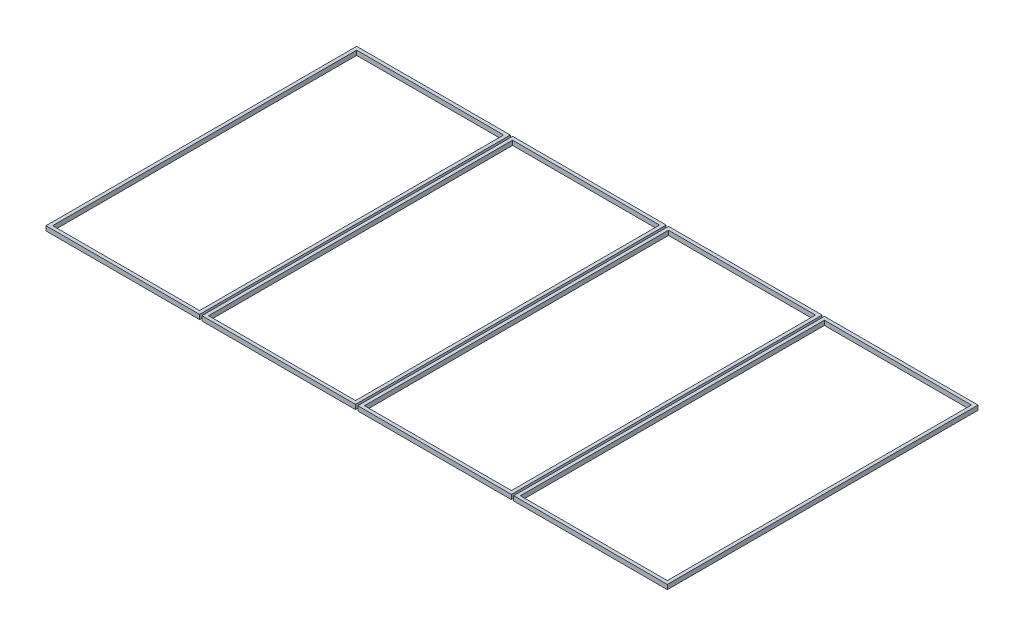
ISO-10303-21;
HEADER;
FILE_DESCRIPTION(('STEP AP214'),'2;1');
FILE_NAME('part.step','',(''),(''),'','','');
FILE_SCHEMA(('AUTOMOTIVE_DESIGN { 1 0 10303 214 1 1 1 1 }'));
ENDSEC;
DATA;
#1=APPLICATION_CONTEXT('core data for automotive mechanical design processes');
#2=APPLICATION_PROTOCOL_DEFINITION('international standard','automotive_design',2000,#1);
#3=PRODUCT_CONTEXT('',#1,'mechanical');
#4=PRODUCT('Part','Part','',(#3));
#5=PRODUCT_RELATED_PRODUCT_CATEGORY('part','',(#4));
#6=PRODUCT_DEFINITION_FORMATION('','',#4);
#7=PRODUCT_DEFINITION_CONTEXT('part definition',#1,'design');
#8=PRODUCT_DEFINITION('design','',#6,#7);
#9=PRODUCT_DEFINITION_SHAPE('','',#8);
#10=(LENGTH_UNIT() NAMED_UNIT(*) SI_UNIT(.MILLI.,.METRE.));
#11=(NAMED_UNIT(*) PLANE_ANGLE_UNIT() SI_UNIT($,.RADIAN.));
#12=(NAMED_UNIT(*) SI_UNIT($,.STERADIAN.) SOLID_ANGLE_UNIT());
#13=UNCERTAINTY_MEASURE_WITH_UNIT(LENGTH_MEASURE(1.E-05),#10,'distance_accuracy_value','');
#14=(GEOMETRIC_REPRESENTATION_CONTEXT(3) GLOBAL_UNCERTAINTY_ASSIGNED_CONTEXT((#13)) GLOBAL_UNIT_ASSIGNED_CONTEXT((#10,
#11,#12)) REPRESENTATION_CONTEXT('',''));
#15=CARTESIAN_POINT('',(0.,0.,0.));
#16=DIRECTION('',(0.,0.,1.));
#17=DIRECTION('',(1.,0.,0.));
#18=AXIS2_PLACEMENT_3D('',#15,#16,#17);
#19=CARTESIAN_POINT('',(0.,18.,0.));
#20=DIRECTION('',(0.,1.,0.));
#21=DIRECTION('',(0.,0.,1.));
#22=AXIS2_PLACEMENT_3D('',#19,#20,#21);
#23=PLANE('',#22);
#24=DIRECTION('',(1.,0.,0.));
#25=VECTOR('',#24,1.);
#26=CARTESIAN_POINT('',(1224.5,18.,0.));
#27=LINE('',#26,#25);
#28=CARTESIAN_POINT('',(1224.5,18.,0.));
#29=VERTEX_POINT('',#28);
#30=CARTESIAN_POINT('',(1827.75,18.,0.));
#31=VERTEX_POINT('',#30);
#32=EDGE_CURVE('E144',#29,#31,#27,.T.);
#33=ORIENTED_EDGE('',*,*,#32,.T.);
#34=DIRECTION('',(0.,0.,-1.));
#35=VECTOR('',#34,1.);
#36=CARTESIAN_POINT('',(1827.75,18.,0.));
#37=LINE('',#36,#35);
#38=CARTESIAN_POINT('',(1827.75,18.,-1220.));
#39=VERTEX_POINT('',#38);
#40=EDGE_CURVE('E146',#31,#39,#37,.T.);
#41=ORIENTED_EDGE('',*,*,#40,.T.);
#42=DIRECTION('',(-1.,0.,0.));
#43=VECTOR('',#42,1.);
#44=CARTESIAN_POINT('',(1224.5,18.,-1220.));
#45=LINE('',#44,#43);
#46=CARTESIAN_POINT('',(1224.5,18.,-1220.));
#47=VERTEX_POINT('',#46);
#48=EDGE_CURVE('E149',#39,#47,#45,.T.);
#49=ORIENTED_EDGE('',*,*,#48,.T.);
#50=DIRECTION('',(0.,0.,1.));
#51=VECTOR('',#50,1.);
#52=CARTESIAN_POINT('',(1224.5,18.,0.));
#53=LINE('',#52,#51);
#54=EDGE_CURVE('E151',#47,#29,#53,.T.);
#55=ORIENTED_EDGE('',*,*,#54,.T.);
#56=EDGE_LOOP('',(#33,#41,#49,#55));
#57=FACE_BOUND('',#56,.T.);
#58=DIRECTION('',(1.,0.,0.));
#59=VECTOR('',#58,1.);
#60=CARTESIAN_POINT('',(1237.5,18.,-13.));
#61=LINE('',#60,#59);
#62=CARTESIAN_POINT('',(1237.5,18.,-13.));
#63=VERTEX_POINT('',#62);
#64=CARTESIAN_POINT('',(1814.75,18.,-13.));
#65=VERTEX_POINT('',#64);
#66=EDGE_CURVE('E116',#63,#65,#61,.T.);
#67=ORIENTED_EDGE('',*,*,#66,.F.);
#68=DIRECTION('',(0.,0.,1.));
#69=VECTOR('',#68,1.);
#70=CARTESIAN_POINT('',(1237.5,18.,-13.));
#71=LINE('',#70,#69);
#72=CARTESIAN_POINT('',(1237.5,18.,-1207.));
#73=VERTEX_POINT('',#72);
#74=EDGE_CURVE('E108',#73,#63,#71,.T.);
#75=ORIENTED_EDGE('',*,*,#74,.F.);
#76=DIRECTION('',(-1.,0.,0.));
#77=VECTOR('',#76,1.);
#78=CARTESIAN_POINT('',(1237.5,18.,-1207.));
#79=LINE('',#78,#77);
#80=CARTESIAN_POINT('',(1814.75,18.,-1207.));
#81=VERTEX_POINT('',#80);
#82=EDGE_CURVE('E130',#81,#73,#79,.T.);
#83=ORIENTED_EDGE('',*,*,#82,.F.);
#84=DIRECTION('',(0.,0.,-1.));
#85=VECTOR('',#84,1.);
#86=CARTESIAN_POINT('',(1814.75,18.,-13.));
#87=LINE('',#86,#85);
#88=EDGE_CURVE('E128',#65,#81,#87,.T.);
#89=ORIENTED_EDGE('',*,*,#88,.F.);
#90=EDGE_LOOP('',(#67,#75,#83,#89));
#91=FACE_BOUND('',#90,.T.);
#92=ADVANCED_FACE('F43',(#57,#91),#23,.T.);
#93=CARTESIAN_POINT('',(0.,0.,0.));
#94=DIRECTION('',(0.,1.,0.));
#95=DIRECTION('',(0.,0.,1.));
#96=AXIS2_PLACEMENT_3D('',#93,#94,#95);
#97=PLANE('',#96);
#98=DIRECTION('',(1.,0.,0.));
#99=VECTOR('',#98,1.);
#100=CARTESIAN_POINT('',(1814.75,0.,0.));
#101=LINE('',#100,#99);
#102=CARTESIAN_POINT('',(1224.5,0.,0.));
#103=VERTEX_POINT('',#102);
#104=CARTESIAN_POINT('',(1827.75,0.,0.));
#105=VERTEX_POINT('',#104);
#106=EDGE_CURVE('E124',#103,#105,#101,.T.);
#107=ORIENTED_EDGE('',*,*,#106,.F.);
#108=DIRECTION('',(0.,0.,1.));
#109=VECTOR('',#108,1.);
#110=CARTESIAN_POINT('',(1224.5,0.,0.));
#111=LINE('',#110,#109);
#112=CARTESIAN_POINT('',(1224.5,0.,-1220.));
#113=VERTEX_POINT('',#112);
#114=EDGE_CURVE('E147',#113,#103,#111,.T.);
#115=ORIENTED_EDGE('',*,*,#114,.F.);
#116=DIRECTION('',(-1.,0.,0.));
#117=VECTOR('',#116,1.);
#118=CARTESIAN_POINT('',(1224.5,0.,-1220.));
#119=LINE('',#118,#117);
#120=CARTESIAN_POINT('',(1827.75,0.,-1220.));
#121=VERTEX_POINT('',#120);
#122=EDGE_CURVE('E157',#121,#113,#119,.T.);
#123=ORIENTED_EDGE('',*,*,#122,.F.);
#124=DIRECTION('',(0.,0.,-1.));
#125=VECTOR('',#124,1.);
#126=CARTESIAN_POINT('',(1827.75,0.,0.));
#127=LINE('',#126,#125);
#128=EDGE_CURVE('E155',#105,#121,#127,.T.);
#129=ORIENTED_EDGE('',*,*,#128,.F.);
#130=EDGE_LOOP('',(#107,#115,#123,#129));
#131=FACE_BOUND('',#130,.T.);
#132=DIRECTION('',(0.,0.,1.));
#133=VECTOR('',#132,1.);
#134=CARTESIAN_POINT('',(1237.5,0.,-13.));
#135=LINE('',#134,#133);
#136=CARTESIAN_POINT('',(1237.5,0.,-1207.));
#137=VERTEX_POINT('',#136);
#138=CARTESIAN_POINT('',(1237.5,0.,-13.));
#139=VERTEX_POINT('',#138);
#140=EDGE_CURVE('E66',#137,#139,#135,.T.);
#141=ORIENTED_EDGE('',*,*,#140,.T.);
#142=DIRECTION('',(1.,0.,0.));
#143=VECTOR('',#142,1.);
#144=CARTESIAN_POINT('',(1237.5,0.,-13.));
#145=LINE('',#144,#143);
#146=CARTESIAN_POINT('',(1814.75,0.,-13.));
#147=VERTEX_POINT('',#146);
#148=EDGE_CURVE('E123',#139,#147,#145,.T.);
#149=ORIENTED_EDGE('',*,*,#148,.T.);
#150=DIRECTION('',(0.,0.,-1.));
#151=VECTOR('',#150,1.);
#152=CARTESIAN_POINT('',(1814.75,0.,-13.));
#153=LINE('',#152,#151);
#154=CARTESIAN_POINT('',(1814.75,0.,-1207.));
#155=VERTEX_POINT('',#154);
#156=EDGE_CURVE('E136',#147,#155,#153,.T.);
#157=ORIENTED_EDGE('',*,*,#156,.T.);
#158=DIRECTION('',(-1.,0.,0.));
#159=VECTOR('',#158,1.);
#160=CARTESIAN_POINT('',(1237.5,0.,-1207.));
#161=LINE('',#160,#159);
#162=EDGE_CURVE('E117',#155,#137,#161,.T.);
#163=ORIENTED_EDGE('',*,*,#162,.T.);
#164=EDGE_LOOP('',(#141,#149,#157,#163));
#165=FACE_BOUND('',#164,.T.);
#166=ADVANCED_FACE('F177',(#131,#165),#97,.F.);
#167=CARTESIAN_POINT('',(1814.75,18.,0.));
#168=DIRECTION('',(0.,0.,-1.));
#169=DIRECTION('',(-1.,0.,0.));
#170=AXIS2_PLACEMENT_3D('',#167,#168,#169);
#171=PLANE('',#170);
#172=ORIENTED_EDGE('',*,*,#106,.T.);
#173=DIRECTION('',(0.,-1.,0.));
#174=VECTOR('',#173,1.);
#175=CARTESIAN_POINT('',(1827.75,18.,0.));
#176=LINE('',#175,#174);
#177=EDGE_CURVE('E12',#31,#105,#176,.T.);
#178=ORIENTED_EDGE('',*,*,#177,.F.);
#179=ORIENTED_EDGE('',*,*,#32,.F.);
#180=DIRECTION('',(0.,-1.,0.));
#181=VECTOR('',#180,1.);
#182=CARTESIAN_POINT('',(1224.5,18.,0.));
#183=LINE('',#182,#181);
#184=EDGE_CURVE('E153',#29,#103,#183,.T.);
#185=ORIENTED_EDGE('',*,*,#184,.T.);
#186=EDGE_LOOP('',(#172,#178,#179,#185));
#187=FACE_BOUND('',#186,.T.);
#188=ADVANCED_FACE('F45',(#187),#171,.F.);
#189=CARTESIAN_POINT('',(1827.75,18.,0.));
#190=DIRECTION('',(-1.,0.,0.));
#191=DIRECTION('',(0.,0.,1.));
#192=AXIS2_PLACEMENT_3D('',#189,#190,#191);
#193=PLANE('',#192);
#194=ORIENTED_EDGE('',*,*,#128,.T.);
#195=DIRECTION('',(0.,-1.,0.));
#196=VECTOR('',#195,1.);
#197=CARTESIAN_POINT('',(1827.75,18.,-1220.));
#198=LINE('',#197,#196);
#199=EDGE_CURVE('E51',#39,#121,#198,.T.);
#200=ORIENTED_EDGE('',*,*,#199,.F.);
#201=ORIENTED_EDGE('',*,*,#40,.F.);
#202=ORIENTED_EDGE('',*,*,#177,.T.);
#203=EDGE_LOOP('',(#194,#200,#201,#202));
#204=FACE_BOUND('',#203,.T.);
#205=ADVANCED_FACE('F187',(#204),#193,.F.);
#206=CARTESIAN_POINT('',(1224.5,18.,-1220.));
#207=DIRECTION('',(0.,0.,1.));
#208=DIRECTION('',(1.,0.,0.));
#209=AXIS2_PLACEMENT_3D('',#206,#207,#208);
#210=PLANE('',#209);
#211=ORIENTED_EDGE('',*,*,#122,.T.);
#212=DIRECTION('',(0.,-1.,0.));
#213=VECTOR('',#212,1.);
#214=CARTESIAN_POINT('',(1224.5,18.,-1220.));
#215=LINE('',#214,#213);
#216=EDGE_CURVE('E163',#47,#113,#215,.T.);
#217=ORIENTED_EDGE('',*,*,#216,.F.);
#218=ORIENTED_EDGE('',*,*,#48,.F.);
#219=ORIENTED_EDGE('',*,*,#199,.T.);
#220=EDGE_LOOP('',(#211,#217,#218,#219));
#221=FACE_BOUND('',#220,.T.);
#222=ADVANCED_FACE('F170',(#221),#210,.F.);
#223=CARTESIAN_POINT('',(1224.5,18.,0.));
#224=DIRECTION('',(1.,0.,0.));
#225=DIRECTION('',(0.,0.,-1.));
#226=AXIS2_PLACEMENT_3D('',#223,#224,#225);
#227=PLANE('',#226);
#228=ORIENTED_EDGE('',*,*,#114,.T.);
#229=ORIENTED_EDGE('',*,*,#184,.F.);
#230=ORIENTED_EDGE('',*,*,#54,.F.);
#231=ORIENTED_EDGE('',*,*,#216,.T.);
#232=EDGE_LOOP('',(#228,#229,#230,#231));
#233=FACE_BOUND('',#232,.T.);
#234=ADVANCED_FACE('F181',(#233),#227,.F.);
#235=CARTESIAN_POINT('',(1237.5,18.,-13.));
#236=DIRECTION('',(1.,0.,0.));
#237=DIRECTION('',(0.,0.,-1.));
#238=AXIS2_PLACEMENT_3D('',#235,#236,#237);
#239=PLANE('',#238);
#240=ORIENTED_EDGE('',*,*,#140,.F.);
#241=DIRECTION('',(0.,-1.,0.));
#242=VECTOR('',#241,1.);
#243=CARTESIAN_POINT('',(1237.5,18.,-1207.));
#244=LINE('',#243,#242);
#245=EDGE_CURVE('E112',#73,#137,#244,.T.);
#246=ORIENTED_EDGE('',*,*,#245,.F.);
#247=ORIENTED_EDGE('',*,*,#74,.T.);
#248=DIRECTION('',(0.,-1.,0.));
#249=VECTOR('',#248,1.);
#250=CARTESIAN_POINT('',(1237.5,18.,-13.));
#251=LINE('',#250,#249);
#252=EDGE_CURVE('E111',#63,#139,#251,.T.);
#253=ORIENTED_EDGE('',*,*,#252,.T.);
#254=EDGE_LOOP('',(#240,#246,#247,#253));
#255=FACE_BOUND('',#254,.T.);
#256=ADVANCED_FACE('F110',(#255),#239,.T.);
#257=CARTESIAN_POINT('',(1237.5,18.,-13.));
#258=DIRECTION('',(0.,0.,-1.));
#259=DIRECTION('',(-1.,0.,0.));
#260=AXIS2_PLACEMENT_3D('',#257,#258,#259);
#261=PLANE('',#260);
#262=ORIENTED_EDGE('',*,*,#148,.F.);
#263=ORIENTED_EDGE('',*,*,#252,.F.);
#264=ORIENTED_EDGE('',*,*,#66,.T.);
#265=DIRECTION('',(0.,-1.,0.));
#266=VECTOR('',#265,1.);
#267=CARTESIAN_POINT('',(1814.75,18.,-13.));
#268=LINE('',#267,#266);
#269=EDGE_CURVE('E125',#65,#147,#268,.T.);
#270=ORIENTED_EDGE('',*,*,#269,.T.);
#271=EDGE_LOOP('',(#262,#263,#264,#270));
#272=FACE_BOUND('',#271,.T.);
#273=ADVANCED_FACE('F120',(#272),#261,.T.);
#274=CARTESIAN_POINT('',(1814.75,18.,-13.));
#275=DIRECTION('',(-1.,0.,0.));
#276=DIRECTION('',(0.,0.,1.));
#277=AXIS2_PLACEMENT_3D('',#274,#275,#276);
#278=PLANE('',#277);
#279=ORIENTED_EDGE('',*,*,#156,.F.);
#280=ORIENTED_EDGE('',*,*,#269,.F.);
#281=ORIENTED_EDGE('',*,*,#88,.T.);
#282=DIRECTION('',(0.,-1.,0.));
#283=VECTOR('',#282,1.);
#284=CARTESIAN_POINT('',(1814.75,18.,-1207.));
#285=LINE('',#284,#283);
#286=EDGE_CURVE('E58',#81,#155,#285,.T.);
#287=ORIENTED_EDGE('',*,*,#286,.T.);
#288=EDGE_LOOP('',(#279,#280,#281,#287));
#289=FACE_BOUND('',#288,.T.);
#290=ADVANCED_FACE('F210',(#289),#278,.T.);
#291=CARTESIAN_POINT('',(1237.5,18.,-1207.));
#292=DIRECTION('',(0.,0.,1.));
#293=DIRECTION('',(1.,0.,0.));
#294=AXIS2_PLACEMENT_3D('',#291,#292,#293);
#295=PLANE('',#294);
#296=ORIENTED_EDGE('',*,*,#162,.F.);
#297=ORIENTED_EDGE('',*,*,#286,.F.);
#298=ORIENTED_EDGE('',*,*,#82,.T.);
#299=ORIENTED_EDGE('',*,*,#245,.T.);
#300=EDGE_LOOP('',(#296,#297,#298,#299));
#301=FACE_BOUND('',#300,.T.);
#302=ADVANCED_FACE('F214',(#301),#295,.T.);
#303=CLOSED_SHELL('',(#92,#166,#188,#205,#222,#234,#256,#273,#290,#302));
#304=MANIFOLD_SOLID_BREP('B2',#303);
#305=CARTESIAN_POINT('',(0.,18.,0.));
#306=DIRECTION('',(0.,1.,0.));
#307=DIRECTION('',(0.,0.,1.));
#308=AXIS2_PLACEMENT_3D('',#305,#306,#307);
#309=PLANE('',#308);
#310=DIRECTION('',(1.,0.,0.));
#311=VECTOR('',#310,1.);
#312=CARTESIAN_POINT('',(612.25,18.,0.));
#313=LINE('',#312,#311);
#314=CARTESIAN_POINT('',(612.25,18.,0.));
#315=VERTEX_POINT('',#314);
#316=CARTESIAN_POINT('',(1215.5,18.,0.));
#317=VERTEX_POINT('',#316);
#318=EDGE_CURVE('E389',#315,#317,#313,.T.);
#319=ORIENTED_EDGE('',*,*,#318,.T.);
#320=DIRECTION('',(0.,0.,-1.));
#321=VECTOR('',#320,1.);
#322=CARTESIAN_POINT('',(1215.5,18.,0.));
#323=LINE('',#322,#321);
#324=CARTESIAN_POINT('',(1215.5,18.,-1220.));
#325=VERTEX_POINT('',#324);
#326=EDGE_CURVE('E391',#317,#325,#323,.T.);
#327=ORIENTED_EDGE('',*,*,#326,.T.);
#328=DIRECTION('',(-1.,0.,0.));
#329=VECTOR('',#328,1.);
#330=CARTESIAN_POINT('',(612.25,18.,-1220.));
#331=LINE('',#330,#329);
#332=CARTESIAN_POINT('',(612.25,18.,-1220.));
#333=VERTEX_POINT('',#332);
#334=EDGE_CURVE('E394',#325,#333,#331,.T.);
#335=ORIENTED_EDGE('',*,*,#334,.T.);
#336=DIRECTION('',(0.,0.,1.));
#337=VECTOR('',#336,1.);
#338=CARTESIAN_POINT('',(612.25,18.,0.));
#339=LINE('',#338,#337);
#340=EDGE_CURVE('E396',#333,#315,#339,.T.);
#341=ORIENTED_EDGE('',*,*,#340,.T.);
#342=EDGE_LOOP('',(#319,#327,#335,#341));
#343=FACE_BOUND('',#342,.T.);
#344=DIRECTION('',(1.,0.,0.));
#345=VECTOR('',#344,1.);
#346=CARTESIAN_POINT('',(625.25,18.,-13.));
#347=LINE('',#346,#345);
#348=CARTESIAN_POINT('',(625.25,18.,-13.));
#349=VERTEX_POINT('',#348);
#350=CARTESIAN_POINT('',(1202.5,18.,-13.));
#351=VERTEX_POINT('',#350);
#352=EDGE_CURVE('E361',#349,#351,#347,.T.);
#353=ORIENTED_EDGE('',*,*,#352,.F.);
#354=DIRECTION('',(0.,0.,1.));
#355=VECTOR('',#354,1.);
#356=CARTESIAN_POINT('',(625.25,18.,-1207.));
#357=LINE('',#356,#355);
#358=CARTESIAN_POINT('',(625.25,18.,-1207.));
#359=VERTEX_POINT('',#358);
#360=EDGE_CURVE('E353',#359,#349,#357,.T.);
#361=ORIENTED_EDGE('',*,*,#360,.F.);
#362=DIRECTION('',(-1.,0.,0.));
#363=VECTOR('',#362,1.);
#364=CARTESIAN_POINT('',(625.25,18.,-1207.));
#365=LINE('',#364,#363);
#366=CARTESIAN_POINT('',(1202.5,18.,-1207.));
#367=VERTEX_POINT('',#366);
#368=EDGE_CURVE('E375',#367,#359,#365,.T.);
#369=ORIENTED_EDGE('',*,*,#368,.F.);
#370=DIRECTION('',(0.,0.,-1.));
#371=VECTOR('',#370,1.);
#372=CARTESIAN_POINT('',(1202.5,18.,-1207.));
#373=LINE('',#372,#371);
#374=EDGE_CURVE('E373',#351,#367,#373,.T.);
#375=ORIENTED_EDGE('',*,*,#374,.F.);
#376=EDGE_LOOP('',(#353,#361,#369,#375));
#377=FACE_BOUND('',#376,.T.);
#378=ADVANCED_FACE('F288',(#343,#377),#309,.T.);
#379=CARTESIAN_POINT('',(0.,0.,0.));
#380=DIRECTION('',(0.,1.,0.));
#381=DIRECTION('',(0.,0.,1.));
#382=AXIS2_PLACEMENT_3D('',#379,#380,#381);
#383=PLANE('',#382);
#384=DIRECTION('',(1.,0.,0.));
#385=VECTOR('',#384,1.);
#386=CARTESIAN_POINT('',(1202.5,0.,0.));
#387=LINE('',#386,#385);
#388=CARTESIAN_POINT('',(612.25,0.,0.));
#389=VERTEX_POINT('',#388);
#390=CARTESIAN_POINT('',(1215.5,0.,0.));
#391=VERTEX_POINT('',#390);
#392=EDGE_CURVE('E369',#389,#391,#387,.T.);
#393=ORIENTED_EDGE('',*,*,#392,.F.);
#394=DIRECTION('',(0.,0.,1.));
#395=VECTOR('',#394,1.);
#396=CARTESIAN_POINT('',(612.25,0.,0.));
#397=LINE('',#396,#395);
#398=CARTESIAN_POINT('',(612.25,0.,-1220.));
#399=VERTEX_POINT('',#398);
#400=EDGE_CURVE('E392',#399,#389,#397,.T.);
#401=ORIENTED_EDGE('',*,*,#400,.F.);
#402=DIRECTION('',(-1.,0.,0.));
#403=VECTOR('',#402,1.);
#404=CARTESIAN_POINT('',(612.25,0.,-1220.));
#405=LINE('',#404,#403);
#406=CARTESIAN_POINT('',(1215.5,0.,-1220.));
#407=VERTEX_POINT('',#406);
#408=EDGE_CURVE('E402',#407,#399,#405,.T.);
#409=ORIENTED_EDGE('',*,*,#408,.F.);
#410=DIRECTION('',(0.,0.,-1.));
#411=VECTOR('',#410,1.);
#412=CARTESIAN_POINT('',(1215.5,0.,0.));
#413=LINE('',#412,#411);
#414=EDGE_CURVE('E400',#391,#407,#413,.T.);
#415=ORIENTED_EDGE('',*,*,#414,.F.);
#416=EDGE_LOOP('',(#393,#401,#409,#415));
#417=FACE_BOUND('',#416,.T.);
#418=DIRECTION('',(0.,0.,1.));
#419=VECTOR('',#418,1.);
#420=CARTESIAN_POINT('',(625.25,0.,-1207.));
#421=LINE('',#420,#419);
#422=CARTESIAN_POINT('',(625.25,0.,-1207.));
#423=VERTEX_POINT('',#422);
#424=CARTESIAN_POINT('',(625.25,0.,-13.));
#425=VERTEX_POINT('',#424);
#426=EDGE_CURVE('E311',#423,#425,#421,.T.);
#427=ORIENTED_EDGE('',*,*,#426,.T.);
#428=DIRECTION('',(1.,0.,0.));
#429=VECTOR('',#428,1.);
#430=CARTESIAN_POINT('',(625.25,0.,-13.));
#431=LINE('',#430,#429);
#432=CARTESIAN_POINT('',(1202.5,0.,-13.));
#433=VERTEX_POINT('',#432);
#434=EDGE_CURVE('E368',#425,#433,#431,.T.);
#435=ORIENTED_EDGE('',*,*,#434,.T.);
#436=DIRECTION('',(0.,0.,-1.));
#437=VECTOR('',#436,1.);
#438=CARTESIAN_POINT('',(1202.5,0.,-1207.));
#439=LINE('',#438,#437);
#440=CARTESIAN_POINT('',(1202.5,0.,-1207.));
#441=VERTEX_POINT('',#440);
#442=EDGE_CURVE('E381',#433,#441,#439,.T.);
#443=ORIENTED_EDGE('',*,*,#442,.T.);
#444=DIRECTION('',(-1.,0.,0.));
#445=VECTOR('',#444,1.);
#446=CARTESIAN_POINT('',(625.25,0.,-1207.));
#447=LINE('',#446,#445);
#448=EDGE_CURVE('E362',#441,#423,#447,.T.);
#449=ORIENTED_EDGE('',*,*,#448,.T.);
#450=EDGE_LOOP('',(#427,#435,#443,#449));
#451=FACE_BOUND('',#450,.T.);
#452=ADVANCED_FACE('F422',(#417,#451),#383,.F.);
#453=CARTESIAN_POINT('',(1202.5,18.,0.));
#454=DIRECTION('',(0.,0.,-1.));
#455=DIRECTION('',(-1.,0.,0.));
#456=AXIS2_PLACEMENT_3D('',#453,#454,#455);
#457=PLANE('',#456);
#458=ORIENTED_EDGE('',*,*,#392,.T.);
#459=DIRECTION('',(0.,-1.,0.));
#460=VECTOR('',#459,1.);
#461=CARTESIAN_POINT('',(1215.5,18.,0.));
#462=LINE('',#461,#460);
#463=EDGE_CURVE('E41',#317,#391,#462,.T.);
#464=ORIENTED_EDGE('',*,*,#463,.F.);
#465=ORIENTED_EDGE('',*,*,#318,.F.);
#466=DIRECTION('',(0.,-1.,0.));
#467=VECTOR('',#466,1.);
#468=CARTESIAN_POINT('',(612.25,18.,0.));
#469=LINE('',#468,#467);
#470=EDGE_CURVE('E398',#315,#389,#469,.T.);
#471=ORIENTED_EDGE('',*,*,#470,.T.);
#472=EDGE_LOOP('',(#458,#464,#465,#471));
#473=FACE_BOUND('',#472,.T.);
#474=ADVANCED_FACE('F290',(#473),#457,.F.);
#475=CARTESIAN_POINT('',(1215.5,18.,0.));
#476=DIRECTION('',(-1.,0.,0.));
#477=DIRECTION('',(0.,0.,1.));
#478=AXIS2_PLACEMENT_3D('',#475,#476,#477);
#479=PLANE('',#478);
#480=ORIENTED_EDGE('',*,*,#414,.T.);
#481=DIRECTION('',(0.,-1.,0.));
#482=VECTOR('',#481,1.);
#483=CARTESIAN_POINT('',(1215.5,18.,-1220.));
#484=LINE('',#483,#482);
#485=EDGE_CURVE('E296',#325,#407,#484,.T.);
#486=ORIENTED_EDGE('',*,*,#485,.F.);
#487=ORIENTED_EDGE('',*,*,#326,.F.);
#488=ORIENTED_EDGE('',*,*,#463,.T.);
#489=EDGE_LOOP('',(#480,#486,#487,#488));
#490=FACE_BOUND('',#489,.T.);
#491=ADVANCED_FACE('F432',(#490),#479,.F.);
#492=CARTESIAN_POINT('',(612.25,18.,-1220.));
#493=DIRECTION('',(0.,0.,1.));
#494=DIRECTION('',(1.,0.,0.));
#495=AXIS2_PLACEMENT_3D('',#492,#493,#494);
#496=PLANE('',#495);
#497=ORIENTED_EDGE('',*,*,#408,.T.);
#498=DIRECTION('',(0.,-1.,0.));
#499=VECTOR('',#498,1.);
#500=CARTESIAN_POINT('',(612.25,18.,-1220.));
#501=LINE('',#500,#499);
#502=EDGE_CURVE('E408',#333,#399,#501,.T.);
#503=ORIENTED_EDGE('',*,*,#502,.F.);
#504=ORIENTED_EDGE('',*,*,#334,.F.);
#505=ORIENTED_EDGE('',*,*,#485,.T.);
#506=EDGE_LOOP('',(#497,#503,#504,#505));
#507=FACE_BOUND('',#506,.T.);
#508=ADVANCED_FACE('F415',(#507),#496,.F.);
#509=CARTESIAN_POINT('',(612.25,18.,0.));
#510=DIRECTION('',(1.,0.,0.));
#511=DIRECTION('',(0.,0.,-1.));
#512=AXIS2_PLACEMENT_3D('',#509,#510,#511);
#513=PLANE('',#512);
#514=ORIENTED_EDGE('',*,*,#400,.T.);
#515=ORIENTED_EDGE('',*,*,#470,.F.);
#516=ORIENTED_EDGE('',*,*,#340,.F.);
#517=ORIENTED_EDGE('',*,*,#502,.T.);
#518=EDGE_LOOP('',(#514,#515,#516,#517));
#519=FACE_BOUND('',#518,.T.);
#520=ADVANCED_FACE('F426',(#519),#513,.F.);
#521=CARTESIAN_POINT('',(625.25,18.,-1207.));
#522=DIRECTION('',(1.,0.,0.));
#523=DIRECTION('',(0.,0.,-1.));
#524=AXIS2_PLACEMENT_3D('',#521,#522,#523);
#525=PLANE('',#524);
#526=ORIENTED_EDGE('',*,*,#426,.F.);
#527=DIRECTION('',(0.,-1.,0.));
#528=VECTOR('',#527,1.);
#529=CARTESIAN_POINT('',(625.25,18.,-1207.));
#530=LINE('',#529,#528);
#531=EDGE_CURVE('E357',#359,#423,#530,.T.);
#532=ORIENTED_EDGE('',*,*,#531,.F.);
#533=ORIENTED_EDGE('',*,*,#360,.T.);
#534=DIRECTION('',(0.,-1.,0.));
#535=VECTOR('',#534,1.);
#536=CARTESIAN_POINT('',(625.25,18.,-13.));
#537=LINE('',#536,#535);
#538=EDGE_CURVE('E356',#349,#425,#537,.T.);
#539=ORIENTED_EDGE('',*,*,#538,.T.);
#540=EDGE_LOOP('',(#526,#532,#533,#539));
#541=FACE_BOUND('',#540,.T.);
#542=ADVANCED_FACE('F355',(#541),#525,.T.);
#543=CARTESIAN_POINT('',(625.25,18.,-13.));
#544=DIRECTION('',(0.,0.,-1.));
#545=DIRECTION('',(-1.,0.,0.));
#546=AXIS2_PLACEMENT_3D('',#543,#544,#545);
#547=PLANE('',#546);
#548=ORIENTED_EDGE('',*,*,#434,.F.);
#549=ORIENTED_EDGE('',*,*,#538,.F.);
#550=ORIENTED_EDGE('',*,*,#352,.T.);
#551=DIRECTION('',(0.,-1.,0.));
#552=VECTOR('',#551,1.);
#553=CARTESIAN_POINT('',(1202.5,18.,-13.));
#554=LINE('',#553,#552);
#555=EDGE_CURVE('E370',#351,#433,#554,.T.);
#556=ORIENTED_EDGE('',*,*,#555,.T.);
#557=EDGE_LOOP('',(#548,#549,#550,#556));
#558=FACE_BOUND('',#557,.T.);
#559=ADVANCED_FACE('F365',(#558),#547,.T.);
#560=CARTESIAN_POINT('',(1202.5,18.,-1207.));
#561=DIRECTION('',(-1.,0.,0.));
#562=DIRECTION('',(0.,0.,1.));
#563=AXIS2_PLACEMENT_3D('',#560,#561,#562);
#564=PLANE('',#563);
#565=ORIENTED_EDGE('',*,*,#442,.F.);
#566=ORIENTED_EDGE('',*,*,#555,.F.);
#567=ORIENTED_EDGE('',*,*,#374,.T.);
#568=DIRECTION('',(0.,-1.,0.));
#569=VECTOR('',#568,1.);
#570=CARTESIAN_POINT('',(1202.5,18.,-1207.));
#571=LINE('',#570,#569);
#572=EDGE_CURVE('E303',#367,#441,#571,.T.);
#573=ORIENTED_EDGE('',*,*,#572,.T.);
#574=EDGE_LOOP('',(#565,#566,#567,#573));
#575=FACE_BOUND('',#574,.T.);
#576=ADVANCED_FACE('F455',(#575),#564,.T.);
#577=CARTESIAN_POINT('',(625.25,18.,-1207.));
#578=DIRECTION('',(0.,0.,1.));
#579=DIRECTION('',(1.,0.,0.));
#580=AXIS2_PLACEMENT_3D('',#577,#578,#579);
#581=PLANE('',#580);
#582=ORIENTED_EDGE('',*,*,#448,.F.);
#583=ORIENTED_EDGE('',*,*,#572,.F.);
#584=ORIENTED_EDGE('',*,*,#368,.T.);
#585=ORIENTED_EDGE('',*,*,#531,.T.);
#586=EDGE_LOOP('',(#582,#583,#584,#585));
#587=FACE_BOUND('',#586,.T.);
#588=ADVANCED_FACE('F459',(#587),#581,.T.);
#589=CLOSED_SHELL('',(#378,#452,#474,#491,#508,#520,#542,#559,#576,#588));
#590=MANIFOLD_SOLID_BREP('B6',#589);
#591=CARTESIAN_POINT('',(0.,18.,0.));
#592=DIRECTION('',(0.,1.,0.));
#593=DIRECTION('',(0.,0.,1.));
#594=AXIS2_PLACEMENT_3D('',#591,#592,#593);
#595=PLANE('',#594);
#596=DIRECTION('',(-1.,0.,0.));
#597=VECTOR('',#596,1.);
#598=CARTESIAN_POINT('',(1836.75,18.,-1220.));
#599=LINE('',#598,#597);
#600=CARTESIAN_POINT('',(2440.,18.,-1220.));
#601=VERTEX_POINT('',#600);
#602=CARTESIAN_POINT('',(1836.75,18.,-1220.));
#603=VERTEX_POINT('',#602);
#604=EDGE_CURVE('E633',#601,#603,#599,.T.);
#605=ORIENTED_EDGE('',*,*,#604,.T.);
#606=DIRECTION('',(0.,0.,1.));
#607=VECTOR('',#606,1.);
#608=CARTESIAN_POINT('',(1836.75,18.,0.));
#609=LINE('',#608,#607);
#610=CARTESIAN_POINT('',(1836.75,18.,0.));
#611=VERTEX_POINT('',#610);
#612=EDGE_CURVE('E636',#603,#611,#609,.T.);
#613=ORIENTED_EDGE('',*,*,#612,.T.);
#614=DIRECTION('',(1.,0.,0.));
#615=VECTOR('',#614,1.);
#616=CARTESIAN_POINT('',(1836.75,18.,0.));
#617=LINE('',#616,#615);
#618=CARTESIAN_POINT('',(2440.,18.,0.));
#619=VERTEX_POINT('',#618);
#620=EDGE_CURVE('E639',#611,#619,#617,.T.);
#621=ORIENTED_EDGE('',*,*,#620,.T.);
#622=DIRECTION('',(0.,0.,-1.));
#623=VECTOR('',#622,1.);
#624=CARTESIAN_POINT('',(2440.,18.,0.));
#625=LINE('',#624,#623);
#626=EDGE_CURVE('E641',#619,#601,#625,.T.);
#627=ORIENTED_EDGE('',*,*,#626,.T.);
#628=EDGE_LOOP('',(#605,#613,#621,#627));
#629=FACE_BOUND('',#628,.T.);
#630=DIRECTION('',(1.,0.,0.));
#631=VECTOR('',#630,1.);
#632=CARTESIAN_POINT('',(1849.75,18.,-13.));
#633=LINE('',#632,#631);
#634=CARTESIAN_POINT('',(1849.75,18.,-13.));
#635=VERTEX_POINT('',#634);
#636=CARTESIAN_POINT('',(2427.,18.,-13.));
#637=VERTEX_POINT('',#636);
#638=EDGE_CURVE('E605',#635,#637,#633,.T.);
#639=ORIENTED_EDGE('',*,*,#638,.F.);
#640=DIRECTION('',(0.,0.,1.));
#641=VECTOR('',#640,1.);
#642=CARTESIAN_POINT('',(1849.75,18.,-1207.));
#643=LINE('',#642,#641);
#644=CARTESIAN_POINT('',(1849.75,18.,-1207.));
#645=VERTEX_POINT('',#644);
#646=EDGE_CURVE('E597',#645,#635,#643,.T.);
#647=ORIENTED_EDGE('',*,*,#646,.F.);
#648=DIRECTION('',(-1.,0.,0.));
#649=VECTOR('',#648,1.);
#650=CARTESIAN_POINT('',(1849.75,18.,-1207.));
#651=LINE('',#650,#649);
#652=CARTESIAN_POINT('',(2427.,18.,-1207.));
#653=VERTEX_POINT('',#652);
#654=EDGE_CURVE('E619',#653,#645,#651,.T.);
#655=ORIENTED_EDGE('',*,*,#654,.F.);
#656=DIRECTION('',(0.,0.,-1.));
#657=VECTOR('',#656,1.);
#658=CARTESIAN_POINT('',(2427.,18.,-1207.));
#659=LINE('',#658,#657);
#660=EDGE_CURVE('E617',#637,#653,#659,.T.);
#661=ORIENTED_EDGE('',*,*,#660,.F.);
#662=EDGE_LOOP('',(#639,#647,#655,#661));
#663=FACE_BOUND('',#662,.T.);
#664=ADVANCED_FACE('F532',(#629,#663),#595,.T.);
#665=CARTESIAN_POINT('',(0.,0.,0.));
#666=DIRECTION('',(0.,1.,0.));
#667=DIRECTION('',(0.,0.,1.));
#668=AXIS2_PLACEMENT_3D('',#665,#666,#667);
#669=PLANE('',#668);
#670=DIRECTION('',(-1.,0.,0.));
#671=VECTOR('',#670,1.);
#672=CARTESIAN_POINT('',(1836.75,0.,-1220.));
#673=LINE('',#672,#671);
#674=CARTESIAN_POINT('',(2440.,0.,-1220.));
#675=VERTEX_POINT('',#674);
#676=CARTESIAN_POINT('',(1836.75,0.,-1220.));
#677=VERTEX_POINT('',#676);
#678=EDGE_CURVE('E613',#675,#677,#673,.T.);
#679=ORIENTED_EDGE('',*,*,#678,.F.);
#680=DIRECTION('',(0.,0.,-1.));
#681=VECTOR('',#680,1.);
#682=CARTESIAN_POINT('',(2440.,0.,0.));
#683=LINE('',#682,#681);
#684=CARTESIAN_POINT('',(2440.,0.,0.));
#685=VERTEX_POINT('',#684);
#686=EDGE_CURVE('E637',#685,#675,#683,.T.);
#687=ORIENTED_EDGE('',*,*,#686,.F.);
#688=DIRECTION('',(1.,0.,0.));
#689=VECTOR('',#688,1.);
#690=CARTESIAN_POINT('',(2427.,0.,0.));
#691=LINE('',#690,#689);
#692=CARTESIAN_POINT('',(1836.75,0.,0.));
#693=VERTEX_POINT('',#692);
#694=EDGE_CURVE('E649',#693,#685,#691,.T.);
#695=ORIENTED_EDGE('',*,*,#694,.F.);
#696=DIRECTION('',(0.,0.,1.));
#697=VECTOR('',#696,1.);
#698=CARTESIAN_POINT('',(1836.75,0.,0.));
#699=LINE('',#698,#697);
#700=EDGE_CURVE('E646',#677,#693,#699,.T.);
#701=ORIENTED_EDGE('',*,*,#700,.F.);
#702=EDGE_LOOP('',(#679,#687,#695,#701));
#703=FACE_BOUND('',#702,.T.);
#704=DIRECTION('',(0.,0.,1.));
#705=VECTOR('',#704,1.);
#706=CARTESIAN_POINT('',(1849.75,0.,-1207.));
#707=LINE('',#706,#705);
#708=CARTESIAN_POINT('',(1849.75,0.,-1207.));
#709=VERTEX_POINT('',#708);
#710=CARTESIAN_POINT('',(1849.75,0.,-13.));
#711=VERTEX_POINT('',#710);
#712=EDGE_CURVE('E555',#709,#711,#707,.T.);
#713=ORIENTED_EDGE('',*,*,#712,.T.);
#714=DIRECTION('',(1.,0.,0.));
#715=VECTOR('',#714,1.);
#716=CARTESIAN_POINT('',(1849.75,0.,-13.));
#717=LINE('',#716,#715);
#718=CARTESIAN_POINT('',(2427.,0.,-13.));
#719=VERTEX_POINT('',#718);
#720=EDGE_CURVE('E612',#711,#719,#717,.T.);
#721=ORIENTED_EDGE('',*,*,#720,.T.);
#722=DIRECTION('',(0.,0.,-1.));
#723=VECTOR('',#722,1.);
#724=CARTESIAN_POINT('',(2427.,0.,-1207.));
#725=LINE('',#724,#723);
#726=CARTESIAN_POINT('',(2427.,0.,-1207.));
#727=VERTEX_POINT('',#726);
#728=EDGE_CURVE('E625',#719,#727,#725,.T.);
#729=ORIENTED_EDGE('',*,*,#728,.T.);
#730=DIRECTION('',(-1.,0.,0.));
#731=VECTOR('',#730,1.);
#732=CARTESIAN_POINT('',(1849.75,0.,-1207.));
#733=LINE('',#732,#731);
#734=EDGE_CURVE('E606',#727,#709,#733,.T.);
#735=ORIENTED_EDGE('',*,*,#734,.T.);
#736=EDGE_LOOP('',(#713,#721,#729,#735));
#737=FACE_BOUND('',#736,.T.);
#738=ADVANCED_FACE('F667',(#703,#737),#669,.F.);
#739=CARTESIAN_POINT('',(1836.75,18.,-1220.));
#740=DIRECTION('',(0.,0.,1.));
#741=DIRECTION('',(1.,0.,0.));
#742=AXIS2_PLACEMENT_3D('',#739,#740,#741);
#743=PLANE('',#742);
#744=ORIENTED_EDGE('',*,*,#678,.T.);
#745=DIRECTION('',(0.,-1.,0.));
#746=VECTOR('',#745,1.);
#747=CARTESIAN_POINT('',(1836.75,18.,-1220.));
#748=LINE('',#747,#746);
#749=EDGE_CURVE('E286',#603,#677,#748,.T.);
#750=ORIENTED_EDGE('',*,*,#749,.F.);
#751=ORIENTED_EDGE('',*,*,#604,.F.);
#752=DIRECTION('',(0.,-1.,0.));
#753=VECTOR('',#752,1.);
#754=CARTESIAN_POINT('',(2440.,18.,-1220.));
#755=LINE('',#754,#753);
#756=EDGE_CURVE('E643',#601,#675,#755,.T.);
#757=ORIENTED_EDGE('',*,*,#756,.T.);
#758=EDGE_LOOP('',(#744,#750,#751,#757));
#759=FACE_BOUND('',#758,.T.);
#760=ADVANCED_FACE('F534',(#759),#743,.F.);
#761=CARTESIAN_POINT('',(1836.75,18.,0.));
#762=DIRECTION('',(1.,0.,0.));
#763=DIRECTION('',(0.,0.,-1.));
#764=AXIS2_PLACEMENT_3D('',#761,#762,#763);
#765=PLANE('',#764);
#766=ORIENTED_EDGE('',*,*,#700,.T.);
#767=DIRECTION('',(0.,-1.,0.));
#768=VECTOR('',#767,1.);
#769=CARTESIAN_POINT('',(1836.75,18.,0.));
#770=LINE('',#769,#768);
#771=EDGE_CURVE('E540',#611,#693,#770,.T.);
#772=ORIENTED_EDGE('',*,*,#771,.F.);
#773=ORIENTED_EDGE('',*,*,#612,.F.);
#774=ORIENTED_EDGE('',*,*,#749,.T.);
#775=EDGE_LOOP('',(#766,#772,#773,#774));
#776=FACE_BOUND('',#775,.T.);
#777=ADVANCED_FACE('F663',(#776),#765,.F.);
#778=CARTESIAN_POINT('',(2427.,18.,0.));
#779=DIRECTION('',(0.,0.,-1.));
#780=DIRECTION('',(-1.,0.,0.));
#781=AXIS2_PLACEMENT_3D('',#778,#779,#780);
#782=PLANE('',#781);
#783=ORIENTED_EDGE('',*,*,#694,.T.);
#784=DIRECTION('',(0.,-1.,0.));
#785=VECTOR('',#784,1.);
#786=CARTESIAN_POINT('',(2440.,18.,0.));
#787=LINE('',#786,#785);
#788=EDGE_CURVE('E654',#619,#685,#787,.T.);
#789=ORIENTED_EDGE('',*,*,#788,.F.);
#790=ORIENTED_EDGE('',*,*,#620,.F.);
#791=ORIENTED_EDGE('',*,*,#771,.T.);
#792=EDGE_LOOP('',(#783,#789,#790,#791));
#793=FACE_BOUND('',#792,.T.);
#794=ADVANCED_FACE('F660',(#793),#782,.F.);
#795=CARTESIAN_POINT('',(2440.,18.,0.));
#796=DIRECTION('',(-1.,0.,0.));
#797=DIRECTION('',(0.,0.,1.));
#798=AXIS2_PLACEMENT_3D('',#795,#796,#797);
#799=PLANE('',#798);
#800=ORIENTED_EDGE('',*,*,#686,.T.);
#801=ORIENTED_EDGE('',*,*,#756,.F.);
#802=ORIENTED_EDGE('',*,*,#626,.F.);
#803=ORIENTED_EDGE('',*,*,#788,.T.);
#804=EDGE_LOOP('',(#800,#801,#802,#803));
#805=FACE_BOUND('',#804,.T.);
#806=ADVANCED_FACE('F672',(#805),#799,.F.);
#807=CARTESIAN_POINT('',(1849.75,18.,-1207.));
#808=DIRECTION('',(1.,0.,0.));
#809=DIRECTION('',(0.,0.,-1.));
#810=AXIS2_PLACEMENT_3D('',#807,#808,#809);
#811=PLANE('',#810);
#812=ORIENTED_EDGE('',*,*,#712,.F.);
#813=DIRECTION('',(0.,-1.,0.));
#814=VECTOR('',#813,1.);
#815=CARTESIAN_POINT('',(1849.75,18.,-1207.));
#816=LINE('',#815,#814);
#817=EDGE_CURVE('E601',#645,#709,#816,.T.);
#818=ORIENTED_EDGE('',*,*,#817,.F.);
#819=ORIENTED_EDGE('',*,*,#646,.T.);
#820=DIRECTION('',(0.,-1.,0.));
#821=VECTOR('',#820,1.);
#822=CARTESIAN_POINT('',(1849.75,18.,-13.));
#823=LINE('',#822,#821);
#824=EDGE_CURVE('E600',#635,#711,#823,.T.);
#825=ORIENTED_EDGE('',*,*,#824,.T.);
#826=EDGE_LOOP('',(#812,#818,#819,#825));
#827=FACE_BOUND('',#826,.T.);
#828=ADVANCED_FACE('F599',(#827),#811,.T.);
#829=CARTESIAN_POINT('',(1849.75,18.,-13.));
#830=DIRECTION('',(0.,0.,-1.));
#831=DIRECTION('',(-1.,0.,0.));
#832=AXIS2_PLACEMENT_3D('',#829,#830,#831);
#833=PLANE('',#832);
#834=ORIENTED_EDGE('',*,*,#720,.F.);
#835=ORIENTED_EDGE('',*,*,#824,.F.);
#836=ORIENTED_EDGE('',*,*,#638,.T.);
#837=DIRECTION('',(0.,-1.,0.));
#838=VECTOR('',#837,1.);
#839=CARTESIAN_POINT('',(2427.,18.,-13.));
#840=LINE('',#839,#838);
#841=EDGE_CURVE('E614',#637,#719,#840,.T.);
#842=ORIENTED_EDGE('',*,*,#841,.T.);
#843=EDGE_LOOP('',(#834,#835,#836,#842));
#844=FACE_BOUND('',#843,.T.);
#845=ADVANCED_FACE('F609',(#844),#833,.T.);
#846=CARTESIAN_POINT('',(2427.,18.,-1207.));
#847=DIRECTION('',(-1.,0.,0.));
#848=DIRECTION('',(0.,0.,1.));
#849=AXIS2_PLACEMENT_3D('',#846,#847,#848);
#850=PLANE('',#849);
#851=ORIENTED_EDGE('',*,*,#728,.F.);
#852=ORIENTED_EDGE('',*,*,#841,.F.);
#853=ORIENTED_EDGE('',*,*,#660,.T.);
#854=DIRECTION('',(0.,-1.,0.));
#855=VECTOR('',#854,1.);
#856=CARTESIAN_POINT('',(2427.,18.,-1207.));
#857=LINE('',#856,#855);
#858=EDGE_CURVE('E547',#653,#727,#857,.T.);
#859=ORIENTED_EDGE('',*,*,#858,.T.);
#860=EDGE_LOOP('',(#851,#852,#853,#859));
#861=FACE_BOUND('',#860,.T.);
#862=ADVANCED_FACE('F741',(#861),#850,.T.);
#863=CARTESIAN_POINT('',(1849.75,18.,-1207.));
#864=DIRECTION('',(0.,0.,1.));
#865=DIRECTION('',(1.,0.,0.));
#866=AXIS2_PLACEMENT_3D('',#863,#864,#865);
#867=PLANE('',#866);
#868=ORIENTED_EDGE('',*,*,#734,.F.);
#869=ORIENTED_EDGE('',*,*,#858,.F.);
#870=ORIENTED_EDGE('',*,*,#654,.T.);
#871=ORIENTED_EDGE('',*,*,#817,.T.);
#872=EDGE_LOOP('',(#868,#869,#870,#871));
#873=FACE_BOUND('',#872,.T.);
#874=ADVANCED_FACE('F748',(#873),#867,.T.);
#875=CLOSED_SHELL('',(#664,#738,#760,#777,#794,#806,#828,#845,#862,#874));
#876=MANIFOLD_SOLID_BREP('B35',#875);
#877=CARTESIAN_POINT('',(0.,18.,0.));
#878=DIRECTION('',(0.,1.,0.));
#879=DIRECTION('',(0.,0.,1.));
#880=AXIS2_PLACEMENT_3D('',#877,#878,#879);
#881=PLANE('',#880);
#882=DIRECTION('',(1.,0.,0.));
#883=VECTOR('',#882,1.);
#884=CARTESIAN_POINT('',(0.,18.,0.));
#885=LINE('',#884,#883);
#886=CARTESIAN_POINT('',(0.,18.,0.));
#887=VERTEX_POINT('',#886);
#888=CARTESIAN_POINT('',(603.25,18.,0.));
#889=VERTEX_POINT('',#888);
#890=EDGE_CURVE('E868',#887,#889,#885,.T.);
#891=ORIENTED_EDGE('',*,*,#890,.T.);
#892=DIRECTION('',(0.,0.,-1.));
#893=VECTOR('',#892,1.);
#894=CARTESIAN_POINT('',(603.25,18.,0.));
#895=LINE('',#894,#893);
#896=CARTESIAN_POINT('',(603.25,18.,-1220.));
#897=VERTEX_POINT('',#896);
#898=EDGE_CURVE('E870',#889,#897,#895,.T.);
#899=ORIENTED_EDGE('',*,*,#898,.T.);
#900=DIRECTION('',(-1.,0.,0.));
#901=VECTOR('',#900,1.);
#902=CARTESIAN_POINT('',(0.,18.,-1220.));
#903=LINE('',#902,#901);
#904=CARTESIAN_POINT('',(0.,18.,-1220.));
#905=VERTEX_POINT('',#904);
#906=EDGE_CURVE('E873',#897,#905,#903,.T.);
#907=ORIENTED_EDGE('',*,*,#906,.T.);
#908=DIRECTION('',(0.,0.,1.));
#909=VECTOR('',#908,1.);
#910=CARTESIAN_POINT('',(0.,18.,0.));
#911=LINE('',#910,#909);
#912=EDGE_CURVE('E875',#905,#887,#911,.T.);
#913=ORIENTED_EDGE('',*,*,#912,.T.);
#914=EDGE_LOOP('',(#891,#899,#907,#913));
#915=FACE_BOUND('',#914,.T.);
#916=DIRECTION('',(1.,0.,0.));
#917=VECTOR('',#916,1.);
#918=CARTESIAN_POINT('',(12.9999999999997,18.,-12.9999999999999));
#919=LINE('',#918,#917);
#920=CARTESIAN_POINT('',(12.9999999999997,18.,-12.9999999999999));
#921=VERTEX_POINT('',#920);
#922=CARTESIAN_POINT('',(590.25,18.,-12.9999999999999));
#923=VERTEX_POINT('',#922);
#924=EDGE_CURVE('E840',#921,#923,#919,.T.);
#925=ORIENTED_EDGE('',*,*,#924,.F.);
#926=DIRECTION('',(0.,0.,1.));
#927=VECTOR('',#926,1.);
#928=CARTESIAN_POINT('',(12.9999999999996,18.,-1207.));
#929=LINE('',#928,#927);
#930=CARTESIAN_POINT('',(12.9999999999996,18.,-1207.));
#931=VERTEX_POINT('',#930);
#932=EDGE_CURVE('E832',#931,#921,#929,.T.);
#933=ORIENTED_EDGE('',*,*,#932,.F.);
#934=DIRECTION('',(-1.,0.,0.));
#935=VECTOR('',#934,1.);
#936=CARTESIAN_POINT('',(12.9999999999996,18.,-1207.));
#937=LINE('',#936,#935);
#938=CARTESIAN_POINT('',(590.25,18.,-1207.));
#939=VERTEX_POINT('',#938);
#940=EDGE_CURVE('E854',#939,#931,#937,.T.);
#941=ORIENTED_EDGE('',*,*,#940,.F.);
#942=DIRECTION('',(0.,0.,-1.));
#943=VECTOR('',#942,1.);
#944=CARTESIAN_POINT('',(590.25,18.,-1207.));
#945=LINE('',#944,#943);
#946=EDGE_CURVE('E852',#923,#939,#945,.T.);
#947=ORIENTED_EDGE('',*,*,#946,.F.);
#948=EDGE_LOOP('',(#925,#933,#941,#947));
#949=FACE_BOUND('',#948,.T.);
#950=ADVANCED_FACE('F767',(#915,#949),#881,.T.);
#951=CARTESIAN_POINT('',(0.,0.,0.));
#952=DIRECTION('',(0.,1.,0.));
#953=DIRECTION('',(0.,0.,1.));
#954=AXIS2_PLACEMENT_3D('',#951,#952,#953);
#955=PLANE('',#954);
#956=DIRECTION('',(1.,0.,0.));
#957=VECTOR('',#956,1.);
#958=CARTESIAN_POINT('',(590.25,0.,0.));
#959=LINE('',#958,#957);
#960=CARTESIAN_POINT('',(0.,0.,0.));
#961=VERTEX_POINT('',#960);
#962=CARTESIAN_POINT('',(603.25,0.,0.));
#963=VERTEX_POINT('',#962);
#964=EDGE_CURVE('E848',#961,#963,#959,.T.);
#965=ORIENTED_EDGE('',*,*,#964,.F.);
#966=DIRECTION('',(0.,0.,1.));
#967=VECTOR('',#966,1.);
#968=CARTESIAN_POINT('',(0.,0.,0.));
#969=LINE('',#968,#967);
#970=CARTESIAN_POINT('',(0.,0.,-1220.));
#971=VERTEX_POINT('',#970);
#972=EDGE_CURVE('E871',#971,#961,#969,.T.);
#973=ORIENTED_EDGE('',*,*,#972,.F.);
#974=DIRECTION('',(-1.,0.,0.));
#975=VECTOR('',#974,1.);
#976=CARTESIAN_POINT('',(0.,0.,-1220.));
#977=LINE('',#976,#975);
#978=CARTESIAN_POINT('',(603.25,0.,-1220.));
#979=VERTEX_POINT('',#978);
#980=EDGE_CURVE('E881',#979,#971,#977,.T.);
#981=ORIENTED_EDGE('',*,*,#980,.F.);
#982=DIRECTION('',(0.,0.,-1.));
#983=VECTOR('',#982,1.);
#984=CARTESIAN_POINT('',(603.25,0.,0.));
#985=LINE('',#984,#983);
#986=EDGE_CURVE('E879',#963,#979,#985,.T.);
#987=ORIENTED_EDGE('',*,*,#986,.F.);
#988=EDGE_LOOP('',(#965,#973,#981,#987));
#989=FACE_BOUND('',#988,.T.);
#990=DIRECTION('',(0.,0.,1.));
#991=VECTOR('',#990,1.);
#992=CARTESIAN_POINT('',(12.9999999999996,0.,-1207.));
#993=LINE('',#992,#991);
#994=CARTESIAN_POINT('',(12.9999999999996,0.,-1207.));
#995=VERTEX_POINT('',#994);
#996=CARTESIAN_POINT('',(12.9999999999997,0.,-12.9999999999999));
#997=VERTEX_POINT('',#996);
#998=EDGE_CURVE('E790',#995,#997,#993,.T.);
#999=ORIENTED_EDGE('',*,*,#998,.T.);
#1000=DIRECTION('',(1.,0.,0.));
#1001=VECTOR('',#1000,1.);
#1002=CARTESIAN_POINT('',(12.9999999999997,0.,-12.9999999999999));
#1003=LINE('',#1002,#1001);
#1004=CARTESIAN_POINT('',(590.25,0.,-12.9999999999999));
#1005=VERTEX_POINT('',#1004);
#1006=EDGE_CURVE('E847',#997,#1005,#1003,.T.);
#1007=ORIENTED_EDGE('',*,*,#1006,.T.);
#1008=DIRECTION('',(0.,0.,-1.));
#1009=VECTOR('',#1008,1.);
#1010=CARTESIAN_POINT('',(590.25,0.,-1207.));
#1011=LINE('',#1010,#1009);
#1012=CARTESIAN_POINT('',(590.25,0.,-1207.));
#1013=VERTEX_POINT('',#1012);
#1014=EDGE_CURVE('E860',#1005,#1013,#1011,.T.);
#1015=ORIENTED_EDGE('',*,*,#1014,.T.);
#1016=DIRECTION('',(-1.,0.,0.));
#1017=VECTOR('',#1016,1.);
#1018=CARTESIAN_POINT('',(12.9999999999996,0.,-1207.));
#1019=LINE('',#1018,#1017);
#1020=EDGE_CURVE('E841',#1013,#995,#1019,.T.);
#1021=ORIENTED_EDGE('',*,*,#1020,.T.);
#1022=EDGE_LOOP('',(#999,#1007,#1015,#1021));
#1023=FACE_BOUND('',#1022,.T.);
#1024=ADVANCED_FACE('F901',(#989,#1023),#955,.F.);
#1025=CARTESIAN_POINT('',(590.25,18.,0.));
#1026=DIRECTION('',(0.,0.,-1.));
#1027=DIRECTION('',(-1.,0.,0.));
#1028=AXIS2_PLACEMENT_3D('',#1025,#1026,#1027);
#1029=PLANE('',#1028);
#1030=ORIENTED_EDGE('',*,*,#964,.T.);
#1031=DIRECTION('',(0.,-1.,0.));
#1032=VECTOR('',#1031,1.);
#1033=CARTESIAN_POINT('',(603.25,18.,0.));
#1034=LINE('',#1033,#1032);
#1035=EDGE_CURVE('E530',#889,#963,#1034,.T.);
#1036=ORIENTED_EDGE('',*,*,#1035,.F.);
#1037=ORIENTED_EDGE('',*,*,#890,.F.);
#1038=DIRECTION('',(0.,-1.,0.));
#1039=VECTOR('',#1038,1.);
#1040=CARTESIAN_POINT('',(0.,18.,0.));
#1041=LINE('',#1040,#1039);
#1042=EDGE_CURVE('E877',#887,#961,#1041,.T.);
#1043=ORIENTED_EDGE('',*,*,#1042,.T.);
#1044=EDGE_LOOP('',(#1030,#1036,#1037,#1043));
#1045=FACE_BOUND('',#1044,.T.);
#1046=ADVANCED_FACE('F769',(#1045),#1029,.F.);
#1047=CARTESIAN_POINT('',(603.25,18.,0.));
#1048=DIRECTION('',(-1.,0.,0.));
#1049=DIRECTION('',(0.,0.,1.));
#1050=AXIS2_PLACEMENT_3D('',#1047,#1048,#1049);
#1051=PLANE('',#1050);
#1052=ORIENTED_EDGE('',*,*,#986,.T.);
#1053=DIRECTION('',(0.,-1.,0.));
#1054=VECTOR('',#1053,1.);
#1055=CARTESIAN_POINT('',(603.25,18.,-1220.));
#1056=LINE('',#1055,#1054);
#1057=EDGE_CURVE('E775',#897,#979,#1056,.T.);
#1058=ORIENTED_EDGE('',*,*,#1057,.F.);
#1059=ORIENTED_EDGE('',*,*,#898,.F.);
#1060=ORIENTED_EDGE('',*,*,#1035,.T.);
#1061=EDGE_LOOP('',(#1052,#1058,#1059,#1060));
#1062=FACE_BOUND('',#1061,.T.);
#1063=ADVANCED_FACE('F911',(#1062),#1051,.F.);
#1064=CARTESIAN_POINT('',(0.,18.,-1220.));
#1065=DIRECTION('',(0.,0.,1.));
#1066=DIRECTION('',(1.,0.,0.));
#1067=AXIS2_PLACEMENT_3D('',#1064,#1065,#1066);
#1068=PLANE('',#1067);
#1069=ORIENTED_EDGE('',*,*,#980,.T.);
#1070=DIRECTION('',(0.,-1.,0.));
#1071=VECTOR('',#1070,1.);
#1072=CARTESIAN_POINT('',(0.,18.,-1220.));
#1073=LINE('',#1072,#1071);
#1074=EDGE_CURVE('E887',#905,#971,#1073,.T.);
#1075=ORIENTED_EDGE('',*,*,#1074,.F.);
#1076=ORIENTED_EDGE('',*,*,#906,.F.);
#1077=ORIENTED_EDGE('',*,*,#1057,.T.);
#1078=EDGE_LOOP('',(#1069,#1075,#1076,#1077));
#1079=FACE_BOUND('',#1078,.T.);
#1080=ADVANCED_FACE('F894',(#1079),#1068,.F.);
#1081=CARTESIAN_POINT('',(0.,18.,0.));
#1082=DIRECTION('',(1.,0.,0.));
#1083=DIRECTION('',(0.,0.,-1.));
#1084=AXIS2_PLACEMENT_3D('',#1081,#1082,#1083);
#1085=PLANE('',#1084);
#1086=ORIENTED_EDGE('',*,*,#972,.T.);
#1087=ORIENTED_EDGE('',*,*,#1042,.F.);
#1088=ORIENTED_EDGE('',*,*,#912,.F.);
#1089=ORIENTED_EDGE('',*,*,#1074,.T.);
#1090=EDGE_LOOP('',(#1086,#1087,#1088,#1089));
#1091=FACE_BOUND('',#1090,.T.);
#1092=ADVANCED_FACE('F905',(#1091),#1085,.F.);
#1093=CARTESIAN_POINT('',(12.9999999999996,18.,-1207.));
#1094=DIRECTION('',(1.,0.,0.));
#1095=DIRECTION('',(0.,0.,-1.));
#1096=AXIS2_PLACEMENT_3D('',#1093,#1094,#1095);
#1097=PLANE('',#1096);
#1098=ORIENTED_EDGE('',*,*,#998,.F.);
#1099=DIRECTION('',(0.,-1.,0.));
#1100=VECTOR('',#1099,1.);
#1101=CARTESIAN_POINT('',(12.9999999999996,18.,-1207.));
#1102=LINE('',#1101,#1100);
#1103=EDGE_CURVE('E836',#931,#995,#1102,.T.);
#1104=ORIENTED_EDGE('',*,*,#1103,.F.);
#1105=ORIENTED_EDGE('',*,*,#932,.T.);
#1106=DIRECTION('',(0.,-1.,0.));
#1107=VECTOR('',#1106,1.);
#1108=CARTESIAN_POINT('',(12.9999999999997,18.,-12.9999999999999));
#1109=LINE('',#1108,#1107);
#1110=EDGE_CURVE('E835',#921,#997,#1109,.T.);
#1111=ORIENTED_EDGE('',*,*,#1110,.T.);
#1112=EDGE_LOOP('',(#1098,#1104,#1105,#1111));
#1113=FACE_BOUND('',#1112,.T.);
#1114=ADVANCED_FACE('F834',(#1113),#1097,.T.);
#1115=CARTESIAN_POINT('',(12.9999999999997,18.,-12.9999999999999));
#1116=DIRECTION('',(0.,0.,-1.));
#1117=DIRECTION('',(-1.,0.,0.));
#1118=AXIS2_PLACEMENT_3D('',#1115,#1116,#1117);
#1119=PLANE('',#1118);
#1120=ORIENTED_EDGE('',*,*,#1006,.F.);
#1121=ORIENTED_EDGE('',*,*,#1110,.F.);
#1122=ORIENTED_EDGE('',*,*,#924,.T.);
#1123=DIRECTION('',(0.,-1.,0.));
#1124=VECTOR('',#1123,1.);
#1125=CARTESIAN_POINT('',(590.25,18.,-12.9999999999999));
#1126=LINE('',#1125,#1124);
#1127=EDGE_CURVE('E849',#923,#1005,#1126,.T.);
#1128=ORIENTED_EDGE('',*,*,#1127,.T.);
#1129=EDGE_LOOP('',(#1120,#1121,#1122,#1128));
#1130=FACE_BOUND('',#1129,.T.);
#1131=ADVANCED_FACE('F844',(#1130),#1119,.T.);
#1132=CARTESIAN_POINT('',(590.25,18.,-1207.));
#1133=DIRECTION('',(-1.,0.,0.));
#1134=DIRECTION('',(0.,0.,1.));
#1135=AXIS2_PLACEMENT_3D('',#1132,#1133,#1134);
#1136=PLANE('',#1135);
#1137=ORIENTED_EDGE('',*,*,#1014,.F.);
#1138=ORIENTED_EDGE('',*,*,#1127,.F.);
#1139=ORIENTED_EDGE('',*,*,#946,.T.);
#1140=DIRECTION('',(0.,-1.,0.));
#1141=VECTOR('',#1140,1.);
#1142=CARTESIAN_POINT('',(590.25,18.,-1207.));
#1143=LINE('',#1142,#1141);
#1144=EDGE_CURVE('E782',#939,#1013,#1143,.T.);
#1145=ORIENTED_EDGE('',*,*,#1144,.T.);
#1146=EDGE_LOOP('',(#1137,#1138,#1139,#1145));
#1147=FACE_BOUND('',#1146,.T.);
#1148=ADVANCED_FACE('F934',(#1147),#1136,.T.);
#1149=CARTESIAN_POINT('',(12.9999999999996,18.,-1207.));
#1150=DIRECTION('',(0.,0.,1.));
#1151=DIRECTION('',(1.,0.,0.));
#1152=AXIS2_PLACEMENT_3D('',#1149,#1150,#1151);
#1153=PLANE('',#1152);
#1154=ORIENTED_EDGE('',*,*,#1020,.F.);
#1155=ORIENTED_EDGE('',*,*,#1144,.F.);
#1156=ORIENTED_EDGE('',*,*,#940,.T.);
#1157=ORIENTED_EDGE('',*,*,#1103,.T.);
#1158=EDGE_LOOP('',(#1154,#1155,#1156,#1157));
#1159=FACE_BOUND('',#1158,.T.);
#1160=ADVANCED_FACE('F938',(#1159),#1153,.T.);
#1161=CLOSED_SHELL('',(#950,#1024,#1046,#1063,#1080,#1092,#1114,#1131,#1148,#1160));
#1162=MANIFOLD_SOLID_BREP('B280',#1161);
#1163=ADVANCED_BREP_SHAPE_REPRESENTATION('',(#18,#304,#590,#876,#1162),#14);
#1164=SHAPE_DEFINITION_REPRESENTATION(#9,#1163);
ENDSEC;
END-ISO-10303-21;
